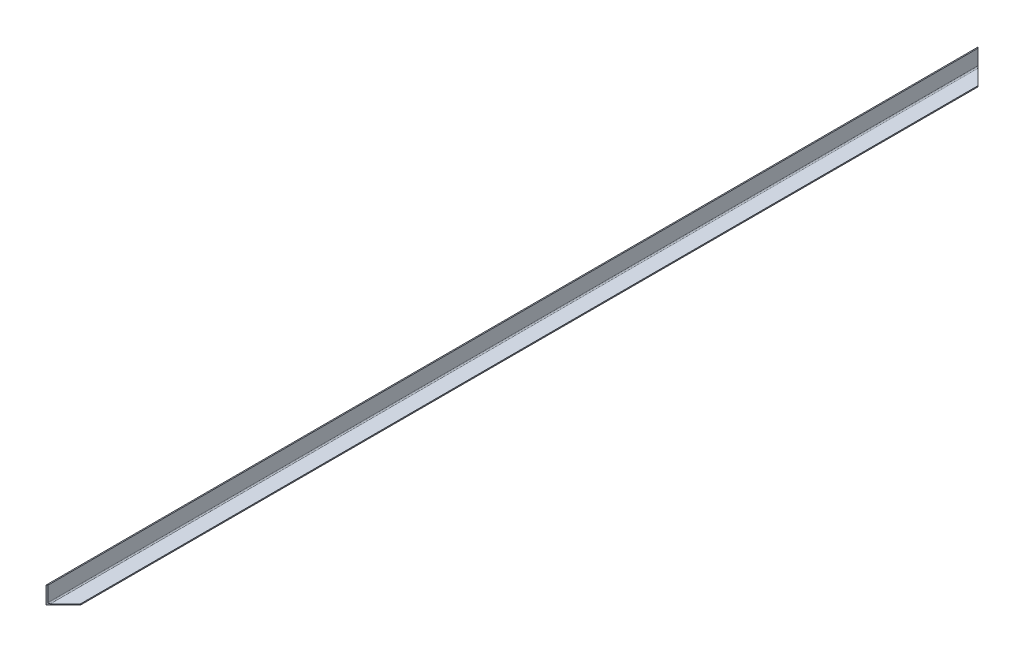
ISO-10303-21;
HEADER;
FILE_DESCRIPTION(('STEP AP214'),'2;1');
FILE_NAME('part.step','',(''),(''),'','','');
FILE_SCHEMA(('AUTOMOTIVE_DESIGN { 1 0 10303 214 1 1 1 1 }'));
ENDSEC;
DATA;
#1=APPLICATION_CONTEXT('core data for automotive mechanical design processes');
#2=APPLICATION_PROTOCOL_DEFINITION('international standard','automotive_design',2000,#1);
#3=PRODUCT_CONTEXT('',#1,'mechanical');
#4=PRODUCT('Part','Part','',(#3));
#5=PRODUCT_RELATED_PRODUCT_CATEGORY('part','',(#4));
#6=PRODUCT_DEFINITION_FORMATION('','',#4);
#7=PRODUCT_DEFINITION_CONTEXT('part definition',#1,'design');
#8=PRODUCT_DEFINITION('design','',#6,#7);
#9=PRODUCT_DEFINITION_SHAPE('','',#8);
#10=(LENGTH_UNIT() NAMED_UNIT(*) SI_UNIT(.MILLI.,.METRE.));
#11=(NAMED_UNIT(*) PLANE_ANGLE_UNIT() SI_UNIT($,.RADIAN.));
#12=(NAMED_UNIT(*) SI_UNIT($,.STERADIAN.) SOLID_ANGLE_UNIT());
#13=UNCERTAINTY_MEASURE_WITH_UNIT(LENGTH_MEASURE(1.E-05),#10,'distance_accuracy_value','');
#14=(GEOMETRIC_REPRESENTATION_CONTEXT(3) GLOBAL_UNCERTAINTY_ASSIGNED_CONTEXT((#13)) GLOBAL_UNIT_ASSIGNED_CONTEXT((#10,
#11,#12)) REPRESENTATION_CONTEXT('',''));
#15=CARTESIAN_POINT('',(0.,0.,0.));
#16=DIRECTION('',(0.,0.,1.));
#17=DIRECTION('',(1.,0.,0.));
#18=AXIS2_PLACEMENT_3D('',#15,#16,#17);
#19=CARTESIAN_POINT('',(-22.225,25.4,-1368.425));
#20=DIRECTION('',(0.,1.,0.));
#21=DIRECTION('',(-1.,0.,0.));
#22=AXIS2_PLACEMENT_3D('',#19,#20,#21);
#23=PLANE('',#22);
#24=DIRECTION('',(0.707106781186548,0.,0.707106781186547));
#25=VECTOR('',#24,1.);
#26=CARTESIAN_POINT('',(-25.4,25.4,-1368.425));
#27=LINE('',#26,#25);
#28=CARTESIAN_POINT('',(-25.4,25.4,-1368.425));
#29=VERTEX_POINT('',#28);
#30=CARTESIAN_POINT('',(-22.225,25.4,-1365.25));
#31=VERTEX_POINT('',#30);
#32=EDGE_CURVE('E114',#29,#31,#27,.T.);
#33=ORIENTED_EDGE('',*,*,#32,.F.);
#34=DIRECTION('',(0.,0.,1.));
#35=VECTOR('',#34,1.);
#36=CARTESIAN_POINT('',(-25.4,25.4,-1368.425));
#37=LINE('',#36,#35);
#38=CARTESIAN_POINT('',(-25.4,25.4,1368.425));
#39=VERTEX_POINT('',#38);
#40=EDGE_CURVE('E50',#29,#39,#37,.T.);
#41=ORIENTED_EDGE('',*,*,#40,.T.);
#42=DIRECTION('',(-0.707106781186548,0.,0.707106781186547));
#43=VECTOR('',#42,1.);
#44=CARTESIAN_POINT('',(-25.4,25.4,1368.425));
#45=LINE('',#44,#43);
#46=CARTESIAN_POINT('',(-22.225,25.4,1365.25));
#47=VERTEX_POINT('',#46);
#48=EDGE_CURVE('E72',#47,#39,#45,.T.);
#49=ORIENTED_EDGE('',*,*,#48,.F.);
#50=DIRECTION('',(0.,0.,1.));
#51=VECTOR('',#50,1.);
#52=CARTESIAN_POINT('',(-22.225,25.4,-1368.425));
#53=LINE('',#52,#51);
#54=EDGE_CURVE('E11',#31,#47,#53,.T.);
#55=ORIENTED_EDGE('',*,*,#54,.F.);
#56=EDGE_LOOP('',(#33,#41,#49,#55));
#57=FACE_BOUND('',#56,.T.);
#58=ADVANCED_FACE('F47',(#57),#23,.T.);
#59=CARTESIAN_POINT('',(-22.225,-18.8383333333333,-1368.425));
#60=DIRECTION('',(1.,0.,0.));
#61=DIRECTION('',(0.,1.,0.));
#62=AXIS2_PLACEMENT_3D('',#59,#60,#61);
#63=PLANE('',#62);
#64=DIRECTION('',(0.,-1.,0.));
#65=VECTOR('',#64,1.);
#66=CARTESIAN_POINT('',(-22.225,-18.8383333333333,-1365.25));
#67=LINE('',#66,#65);
#68=CARTESIAN_POINT('',(-22.225,-18.8383333333333,-1365.25));
#69=VERTEX_POINT('',#68);
#70=EDGE_CURVE('E149',#31,#69,#67,.T.);
#71=ORIENTED_EDGE('',*,*,#70,.F.);
#72=ORIENTED_EDGE('',*,*,#54,.T.);
#73=DIRECTION('',(0.,1.,0.));
#74=VECTOR('',#73,1.);
#75=CARTESIAN_POINT('',(-22.225,-18.8383333333338,1365.25));
#76=LINE('',#75,#74);
#77=CARTESIAN_POINT('',(-22.225,-18.8383333333333,1365.25));
#78=VERTEX_POINT('',#77);
#79=EDGE_CURVE('E158',#78,#47,#76,.T.);
#80=ORIENTED_EDGE('',*,*,#79,.F.);
#81=DIRECTION('',(0.,0.,1.));
#82=VECTOR('',#81,1.);
#83=CARTESIAN_POINT('',(-22.225,-18.8383333333333,-1368.425));
#84=LINE('',#83,#82);
#85=EDGE_CURVE('E56',#69,#78,#84,.T.);
#86=ORIENTED_EDGE('',*,*,#85,.F.);
#87=EDGE_LOOP('',(#71,#72,#80,#86));
#88=FACE_BOUND('',#87,.T.);
#89=ADVANCED_FACE('F201',(#88),#63,.T.);
#90=CARTESIAN_POINT('',(-18.8383333333333,-18.8383333333333,-1368.425));
#91=DIRECTION('',(0.,0.,1.));
#92=DIRECTION('',(1.,0.,0.));
#93=AXIS2_PLACEMENT_3D('',#90,#91,#92);
#94=CYLINDRICAL_SURFACE('',#93,3.38666666666666);
#95=CARTESIAN_POINT('',(-18.8383333333333,-18.8383333333333,-1361.86333333333));
#96=DIRECTION('',(-0.707106781186547,0.,0.707106781186548));
#97=DIRECTION('',(0.707106781186548,0.,0.707106781186547));
#98=AXIS2_PLACEMENT_3D('',#95,#96,#97);
#99=ELLIPSE('',#98,4.78946993123688,3.38666666666666);
#100=CARTESIAN_POINT('',(-18.8383333333333,-22.225,-1361.86333333333));
#101=VERTEX_POINT('',#100);
#102=EDGE_CURVE('E152',#69,#101,#99,.T.);
#103=ORIENTED_EDGE('',*,*,#102,.F.);
#104=ORIENTED_EDGE('',*,*,#85,.T.);
#105=CARTESIAN_POINT('',(-18.8383333333333,-18.8383333333333,1361.86333333333));
#106=DIRECTION('',(-0.707106781186547,0.,-0.707106781186548));
#107=DIRECTION('',(-0.707106781186548,0.,0.707106781186547));
#108=AXIS2_PLACEMENT_3D('',#105,#106,#107);
#109=ELLIPSE('',#108,4.78946993123688,3.38666666666666);
#110=CARTESIAN_POINT('',(-18.8383333333333,-22.225,1361.86333333333));
#111=VERTEX_POINT('',#110);
#112=EDGE_CURVE('E161',#111,#78,#109,.T.);
#113=ORIENTED_EDGE('',*,*,#112,.F.);
#114=DIRECTION('',(0.,0.,1.));
#115=VECTOR('',#114,1.);
#116=CARTESIAN_POINT('',(-18.8383333333333,-22.225,-1368.425));
#117=LINE('',#116,#115);
#118=EDGE_CURVE('E140',#101,#111,#117,.T.);
#119=ORIENTED_EDGE('',*,*,#118,.F.);
#120=EDGE_LOOP('',(#103,#104,#113,#119));
#121=FACE_BOUND('',#120,.T.);
#122=ADVANCED_FACE('F197',(#121),#94,.F.);
#123=CARTESIAN_POINT('',(25.4,-22.225,-1368.425));
#124=DIRECTION('',(0.,1.,0.));
#125=DIRECTION('',(-1.,0.,0.));
#126=AXIS2_PLACEMENT_3D('',#123,#124,#125);
#127=PLANE('',#126);
#128=DIRECTION('',(0.707106781186548,0.,0.707106781186547));
#129=VECTOR('',#128,1.);
#130=CARTESIAN_POINT('',(0.,-22.225,-1343.025));
#131=LINE('',#130,#129);
#132=CARTESIAN_POINT('',(25.4,-22.225,-1317.625));
#133=VERTEX_POINT('',#132);
#134=EDGE_CURVE('E155',#101,#133,#131,.T.);
#135=ORIENTED_EDGE('',*,*,#134,.F.);
#136=ORIENTED_EDGE('',*,*,#118,.T.);
#137=DIRECTION('',(-0.707106781186548,0.,0.707106781186547));
#138=VECTOR('',#137,1.);
#139=CARTESIAN_POINT('',(1368.425,-22.2249999999999,-25.399999999999));
#140=LINE('',#139,#138);
#141=CARTESIAN_POINT('',(25.4,-22.225,1317.625));
#142=VERTEX_POINT('',#141);
#143=EDGE_CURVE('E164',#142,#111,#140,.T.);
#144=ORIENTED_EDGE('',*,*,#143,.F.);
#145=DIRECTION('',(0.,0.,1.));
#146=VECTOR('',#145,1.);
#147=CARTESIAN_POINT('',(25.4,-22.225,-1368.425));
#148=LINE('',#147,#146);
#149=EDGE_CURVE('E134',#133,#142,#148,.T.);
#150=ORIENTED_EDGE('',*,*,#149,.F.);
#151=EDGE_LOOP('',(#135,#136,#144,#150));
#152=FACE_BOUND('',#151,.T.);
#153=ADVANCED_FACE('F193',(#152),#127,.T.);
#154=CARTESIAN_POINT('',(25.4,-25.4,-1368.425));
#155=DIRECTION('',(1.,0.,0.));
#156=DIRECTION('',(0.,1.,0.));
#157=AXIS2_PLACEMENT_3D('',#154,#155,#156);
#158=PLANE('',#157);
#159=DIRECTION('',(0.,1.,0.));
#160=VECTOR('',#159,1.);
#161=CARTESIAN_POINT('',(25.4,-25.4,-1317.625));
#162=LINE('',#161,#160);
#163=CARTESIAN_POINT('',(25.4,-25.4,-1317.625));
#164=VERTEX_POINT('',#163);
#165=EDGE_CURVE('E167',#164,#133,#162,.T.);
#166=ORIENTED_EDGE('',*,*,#165,.T.);
#167=ORIENTED_EDGE('',*,*,#149,.T.);
#168=DIRECTION('',(0.,1.,0.));
#169=VECTOR('',#168,1.);
#170=CARTESIAN_POINT('',(25.4,-25.4,1317.625));
#171=LINE('',#170,#169);
#172=CARTESIAN_POINT('',(25.4,-25.4,1317.625));
#173=VERTEX_POINT('',#172);
#174=EDGE_CURVE('E174',#173,#142,#171,.T.);
#175=ORIENTED_EDGE('',*,*,#174,.F.);
#176=DIRECTION('',(0.,0.,1.));
#177=VECTOR('',#176,1.);
#178=CARTESIAN_POINT('',(25.4,-25.4,-1368.425));
#179=LINE('',#178,#177);
#180=EDGE_CURVE('E131',#164,#173,#179,.T.);
#181=ORIENTED_EDGE('',*,*,#180,.F.);
#182=EDGE_LOOP('',(#166,#167,#175,#181));
#183=FACE_BOUND('',#182,.T.);
#184=ADVANCED_FACE('F186',(#183),#158,.T.);
#185=CARTESIAN_POINT('',(-25.4,-25.4,-1368.425));
#186=DIRECTION('',(0.,-1.,0.));
#187=DIRECTION('',(1.,0.,0.));
#188=AXIS2_PLACEMENT_3D('',#185,#186,#187);
#189=PLANE('',#188);
#190=DIRECTION('',(0.707106781186548,0.,0.707106781186547));
#191=VECTOR('',#190,1.);
#192=CARTESIAN_POINT('',(-25.4,-25.4,-1368.425));
#193=LINE('',#192,#191);
#194=CARTESIAN_POINT('',(-25.4,-25.4,-1368.425));
#195=VERTEX_POINT('',#194);
#196=EDGE_CURVE('E64',#195,#164,#193,.T.);
#197=ORIENTED_EDGE('',*,*,#196,.T.);
#198=ORIENTED_EDGE('',*,*,#180,.T.);
#199=DIRECTION('',(-0.707106781186548,0.,0.707106781186547));
#200=VECTOR('',#199,1.);
#201=CARTESIAN_POINT('',(-25.4,-25.4,1368.425));
#202=LINE('',#201,#200);
#203=CARTESIAN_POINT('',(-25.4,-25.4,1368.425));
#204=VERTEX_POINT('',#203);
#205=EDGE_CURVE('E170',#173,#204,#202,.T.);
#206=ORIENTED_EDGE('',*,*,#205,.T.);
#207=DIRECTION('',(0.,0.,1.));
#208=VECTOR('',#207,1.);
#209=CARTESIAN_POINT('',(-25.4,-25.4,-1368.425));
#210=LINE('',#209,#208);
#211=EDGE_CURVE('E129',#195,#204,#210,.T.);
#212=ORIENTED_EDGE('',*,*,#211,.F.);
#213=EDGE_LOOP('',(#197,#198,#206,#212));
#214=FACE_BOUND('',#213,.T.);
#215=ADVANCED_FACE('F183',(#214),#189,.T.);
#216=CARTESIAN_POINT('',(-25.4,25.4,-1368.425));
#217=DIRECTION('',(-1.,0.,0.));
#218=DIRECTION('',(0.,-1.,0.));
#219=AXIS2_PLACEMENT_3D('',#216,#217,#218);
#220=PLANE('',#219);
#221=ORIENTED_EDGE('',*,*,#211,.T.);
#222=DIRECTION('',(0.,-1.,0.));
#223=VECTOR('',#222,1.);
#224=CARTESIAN_POINT('',(-25.4,25.4,1368.425));
#225=LINE('',#224,#223);
#226=EDGE_CURVE('E120',#39,#204,#225,.T.);
#227=ORIENTED_EDGE('',*,*,#226,.F.);
#228=ORIENTED_EDGE('',*,*,#40,.F.);
#229=DIRECTION('',(0.,-1.,0.));
#230=VECTOR('',#229,1.);
#231=CARTESIAN_POINT('',(-25.4,25.4,-1368.425));
#232=LINE('',#231,#230);
#233=EDGE_CURVE('E111',#29,#195,#232,.T.);
#234=ORIENTED_EDGE('',*,*,#233,.T.);
#235=EDGE_LOOP('',(#221,#227,#228,#234));
#236=FACE_BOUND('',#235,.T.);
#237=ADVANCED_FACE('F127',(#236),#220,.T.);
#238=CARTESIAN_POINT('',(-25.4,-25.4,1368.425));
#239=DIRECTION('',(-0.707106781186547,0.,-0.707106781186548));
#240=DIRECTION('',(-0.707106781186548,0.,0.707106781186547));
#241=AXIS2_PLACEMENT_3D('',#238,#239,#240);
#242=PLANE('',#241);
#243=ORIENTED_EDGE('',*,*,#79,.T.);
#244=ORIENTED_EDGE('',*,*,#48,.T.);
#245=ORIENTED_EDGE('',*,*,#226,.T.);
#246=ORIENTED_EDGE('',*,*,#205,.F.);
#247=ORIENTED_EDGE('',*,*,#174,.T.);
#248=ORIENTED_EDGE('',*,*,#143,.T.);
#249=ORIENTED_EDGE('',*,*,#112,.T.);
#250=EDGE_LOOP('',(#243,#244,#245,#246,#247,#248,#249));
#251=FACE_BOUND('',#250,.T.);
#252=ADVANCED_FACE('F189',(#251),#242,.F.);
#253=CARTESIAN_POINT('',(-25.4,-25.4,-1368.425));
#254=DIRECTION('',(-0.707106781186547,0.,0.707106781186548));
#255=DIRECTION('',(0.707106781186548,0.,0.707106781186547));
#256=AXIS2_PLACEMENT_3D('',#253,#254,#255);
#257=PLANE('',#256);
#258=ORIENTED_EDGE('',*,*,#70,.T.);
#259=ORIENTED_EDGE('',*,*,#102,.T.);
#260=ORIENTED_EDGE('',*,*,#134,.T.);
#261=ORIENTED_EDGE('',*,*,#165,.F.);
#262=ORIENTED_EDGE('',*,*,#196,.F.);
#263=ORIENTED_EDGE('',*,*,#233,.F.);
#264=ORIENTED_EDGE('',*,*,#32,.T.);
#265=EDGE_LOOP('',(#258,#259,#260,#261,#262,#263,#264));
#266=FACE_BOUND('',#265,.T.);
#267=ADVANCED_FACE('F113',(#266),#257,.F.);
#268=CLOSED_SHELL('',(#58,#89,#122,#153,#184,#215,#237,#252,#267));
#269=MANIFOLD_SOLID_BREP('B2',#268);
#270=ADVANCED_BREP_SHAPE_REPRESENTATION('',(#18,#269),#14);
#271=SHAPE_DEFINITION_REPRESENTATION(#9,#270);
ENDSEC;
END-ISO-10303-21;
